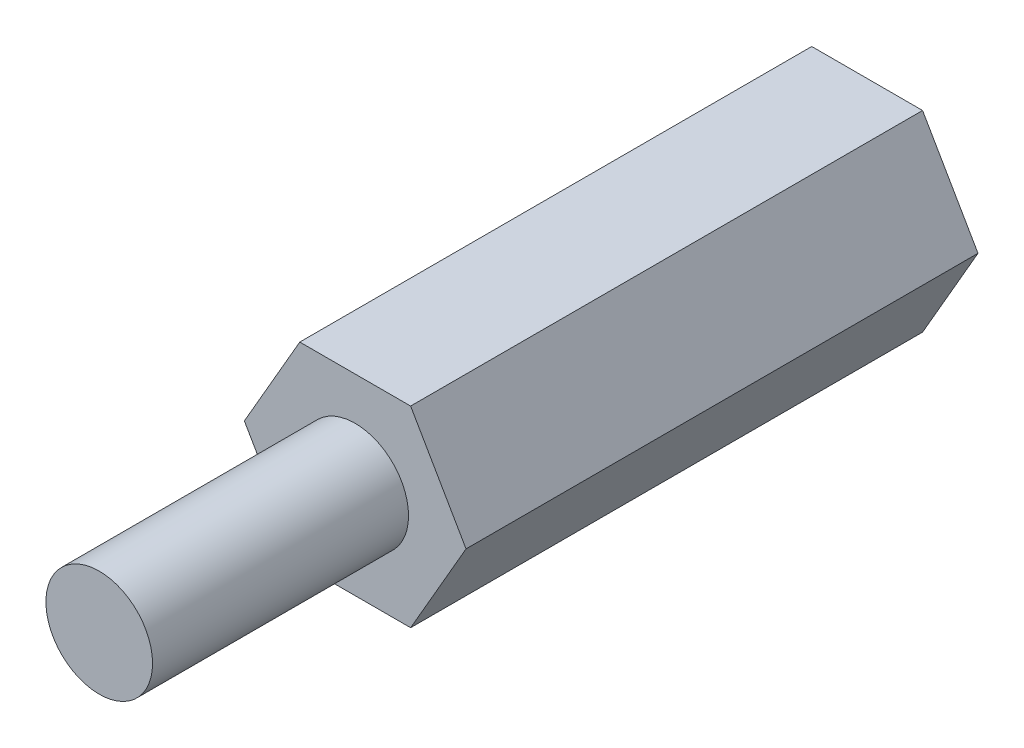
ISO-10303-21;
HEADER;
FILE_DESCRIPTION(('STEP AP214'),'2;1');
FILE_NAME('part.step','',(''),(''),'','','');
FILE_SCHEMA(('AUTOMOTIVE_DESIGN { 1 0 10303 214 1 1 1 1 }'));
ENDSEC;
DATA;
#1=APPLICATION_CONTEXT('core data for automotive mechanical design processes');
#2=APPLICATION_PROTOCOL_DEFINITION('international standard','automotive_design',2000,#1);
#3=PRODUCT_CONTEXT('',#1,'mechanical');
#4=PRODUCT('Part','Part','',(#3));
#5=PRODUCT_RELATED_PRODUCT_CATEGORY('part','',(#4));
#6=PRODUCT_DEFINITION_FORMATION('','',#4);
#7=PRODUCT_DEFINITION_CONTEXT('part definition',#1,'design');
#8=PRODUCT_DEFINITION('design','',#6,#7);
#9=PRODUCT_DEFINITION_SHAPE('','',#8);
#10=(LENGTH_UNIT() NAMED_UNIT(*) SI_UNIT(.MILLI.,.METRE.));
#11=(NAMED_UNIT(*) PLANE_ANGLE_UNIT() SI_UNIT($,.RADIAN.));
#12=(NAMED_UNIT(*) SI_UNIT($,.STERADIAN.) SOLID_ANGLE_UNIT());
#13=UNCERTAINTY_MEASURE_WITH_UNIT(LENGTH_MEASURE(1.E-05),#10,'distance_accuracy_value','');
#14=(GEOMETRIC_REPRESENTATION_CONTEXT(3) GLOBAL_UNCERTAINTY_ASSIGNED_CONTEXT((#13)) GLOBAL_UNIT_ASSIGNED_CONTEXT((#10,
#11,#12)) REPRESENTATION_CONTEXT('',''));
#15=CARTESIAN_POINT('',(0.,0.,0.));
#16=DIRECTION('',(0.,0.,1.));
#17=DIRECTION('',(1.,0.,0.));
#18=AXIS2_PLACEMENT_3D('',#15,#16,#17);
#19=CARTESIAN_POINT('',(1.29903810567668,-2.24999999999998,12.));
#20=DIRECTION('',(-0.866025403784441,0.499999999999995,0.));
#21=DIRECTION('',(-0.499999999999995,-0.866025403784441,0.));
#22=AXIS2_PLACEMENT_3D('',#19,#20,#21);
#23=PLANE('',#22);
#24=DIRECTION('',(0.499999999999995,0.866025403784441,0.));
#25=VECTOR('',#24,1.);
#26=CARTESIAN_POINT('',(1.29903810567668,-2.24999999999998,0.));
#27=LINE('',#26,#25);
#28=CARTESIAN_POINT('',(1.29903810567668,-2.24999999999998,0.));
#29=VERTEX_POINT('',#28);
#30=CARTESIAN_POINT('',(2.59807621135331,0.,0.));
#31=VERTEX_POINT('',#30);
#32=EDGE_CURVE('E136',#29,#31,#27,.T.);
#33=ORIENTED_EDGE('',*,*,#32,.T.);
#34=DIRECTION('',(0.,0.,-1.));
#35=VECTOR('',#34,1.);
#36=CARTESIAN_POINT('',(2.59807621135331,0.,12.));
#37=LINE('',#36,#35);
#38=CARTESIAN_POINT('',(2.59807621135331,0.,12.));
#39=VERTEX_POINT('',#38);
#40=EDGE_CURVE('E51',#39,#31,#37,.T.);
#41=ORIENTED_EDGE('',*,*,#40,.F.);
#42=DIRECTION('',(0.499999999999995,0.866025403784441,0.));
#43=VECTOR('',#42,1.);
#44=CARTESIAN_POINT('',(1.29903810567668,-2.24999999999998,12.));
#45=LINE('',#44,#43);
#46=CARTESIAN_POINT('',(1.29903810567668,-2.24999999999998,12.));
#47=VERTEX_POINT('',#46);
#48=EDGE_CURVE('E147',#47,#39,#45,.T.);
#49=ORIENTED_EDGE('',*,*,#48,.F.);
#50=DIRECTION('',(0.,0.,-1.));
#51=VECTOR('',#50,1.);
#52=CARTESIAN_POINT('',(1.29903810567668,-2.24999999999998,12.));
#53=LINE('',#52,#51);
#54=EDGE_CURVE('E132',#47,#29,#53,.T.);
#55=ORIENTED_EDGE('',*,*,#54,.T.);
#56=EDGE_LOOP('',(#33,#41,#49,#55));
#57=FACE_BOUND('',#56,.T.);
#58=ADVANCED_FACE('F48',(#57),#23,.F.);
#59=CARTESIAN_POINT('',(2.59807621135331,0.,12.));
#60=DIRECTION('',(-0.866025403784438,-0.500000000000001,0.));
#61=DIRECTION('',(0.500000000000001,-0.866025403784438,0.));
#62=AXIS2_PLACEMENT_3D('',#59,#60,#61);
#63=PLANE('',#62);
#64=DIRECTION('',(-0.500000000000001,0.866025403784438,0.));
#65=VECTOR('',#64,1.);
#66=CARTESIAN_POINT('',(2.59807621135331,0.,0.));
#67=LINE('',#66,#65);
#68=CARTESIAN_POINT('',(1.29903810567665,2.25,0.));
#69=VERTEX_POINT('',#68);
#70=EDGE_CURVE('E139',#31,#69,#67,.T.);
#71=ORIENTED_EDGE('',*,*,#70,.T.);
#72=DIRECTION('',(0.,0.,-1.));
#73=VECTOR('',#72,1.);
#74=CARTESIAN_POINT('',(1.29903810567665,2.25,12.));
#75=LINE('',#74,#73);
#76=CARTESIAN_POINT('',(1.29903810567665,2.25,12.));
#77=VERTEX_POINT('',#76);
#78=EDGE_CURVE('E150',#77,#69,#75,.T.);
#79=ORIENTED_EDGE('',*,*,#78,.F.);
#80=DIRECTION('',(-0.500000000000001,0.866025403784438,0.));
#81=VECTOR('',#80,1.);
#82=CARTESIAN_POINT('',(2.59807621135331,0.,12.));
#83=LINE('',#82,#81);
#84=EDGE_CURVE('E104',#39,#77,#83,.T.);
#85=ORIENTED_EDGE('',*,*,#84,.F.);
#86=ORIENTED_EDGE('',*,*,#40,.T.);
#87=EDGE_LOOP('',(#71,#79,#85,#86));
#88=FACE_BOUND('',#87,.T.);
#89=ADVANCED_FACE('F155',(#88),#63,.F.);
#90=CARTESIAN_POINT('',(1.29903810567665,2.25,12.));
#91=DIRECTION('',(0.,-1.,0.));
#92=DIRECTION('',(1.,0.,0.));
#93=AXIS2_PLACEMENT_3D('',#90,#91,#92);
#94=PLANE('',#93);
#95=DIRECTION('',(-1.,0.,0.));
#96=VECTOR('',#95,1.);
#97=CARTESIAN_POINT('',(1.29903810567665,2.25,0.));
#98=LINE('',#97,#96);
#99=CARTESIAN_POINT('',(-1.29903810567667,2.24999999999999,0.));
#100=VERTEX_POINT('',#99);
#101=EDGE_CURVE('E142',#69,#100,#98,.T.);
#102=ORIENTED_EDGE('',*,*,#101,.T.);
#103=DIRECTION('',(0.,0.,-1.));
#104=VECTOR('',#103,1.);
#105=CARTESIAN_POINT('',(-1.29903810567667,2.24999999999999,12.));
#106=LINE('',#105,#104);
#107=CARTESIAN_POINT('',(-1.29903810567667,2.24999999999999,12.));
#108=VERTEX_POINT('',#107);
#109=EDGE_CURVE('E127',#108,#100,#106,.T.);
#110=ORIENTED_EDGE('',*,*,#109,.F.);
#111=DIRECTION('',(-1.,0.,0.));
#112=VECTOR('',#111,1.);
#113=CARTESIAN_POINT('',(1.29903810567665,2.25,12.));
#114=LINE('',#113,#112);
#115=EDGE_CURVE('E118',#77,#108,#114,.T.);
#116=ORIENTED_EDGE('',*,*,#115,.F.);
#117=ORIENTED_EDGE('',*,*,#78,.T.);
#118=EDGE_LOOP('',(#102,#110,#116,#117));
#119=FACE_BOUND('',#118,.T.);
#120=ADVANCED_FACE('F161',(#119),#94,.F.);
#121=CARTESIAN_POINT('',(-1.29903810567667,2.24999999999999,12.));
#122=DIRECTION('',(0.866025403784441,-0.499999999999995,0.));
#123=DIRECTION('',(0.499999999999995,0.866025403784442,0.));
#124=AXIS2_PLACEMENT_3D('',#121,#122,#123);
#125=PLANE('',#124);
#126=DIRECTION('',(-0.499999999999995,-0.866025403784442,0.));
#127=VECTOR('',#126,1.);
#128=CARTESIAN_POINT('',(-1.29903810567667,2.24999999999999,0.));
#129=LINE('',#128,#127);
#130=CARTESIAN_POINT('',(-2.59807621135331,0.,0.));
#131=VERTEX_POINT('',#130);
#132=EDGE_CURVE('E126',#100,#131,#129,.T.);
#133=ORIENTED_EDGE('',*,*,#132,.T.);
#134=DIRECTION('',(0.,0.,-1.));
#135=VECTOR('',#134,1.);
#136=CARTESIAN_POINT('',(-2.59807621135331,0.,12.));
#137=LINE('',#136,#135);
#138=CARTESIAN_POINT('',(-2.59807621135331,0.,12.));
#139=VERTEX_POINT('',#138);
#140=EDGE_CURVE('E123',#139,#131,#137,.T.);
#141=ORIENTED_EDGE('',*,*,#140,.F.);
#142=DIRECTION('',(-0.499999999999995,-0.866025403784442,0.));
#143=VECTOR('',#142,1.);
#144=CARTESIAN_POINT('',(-1.29903810567667,2.24999999999999,12.));
#145=LINE('',#144,#143);
#146=EDGE_CURVE('E112',#108,#139,#145,.T.);
#147=ORIENTED_EDGE('',*,*,#146,.F.);
#148=ORIENTED_EDGE('',*,*,#109,.T.);
#149=EDGE_LOOP('',(#133,#141,#147,#148));
#150=FACE_BOUND('',#149,.T.);
#151=ADVANCED_FACE('F124',(#150),#125,.F.);
#152=CARTESIAN_POINT('',(-2.59807621135331,0.,12.));
#153=DIRECTION('',(0.866025403784434,0.500000000000007,0.));
#154=DIRECTION('',(-0.500000000000007,0.866025403784435,0.));
#155=AXIS2_PLACEMENT_3D('',#152,#153,#154);
#156=PLANE('',#155);
#157=DIRECTION('',(0.500000000000007,-0.866025403784435,0.));
#158=VECTOR('',#157,1.);
#159=CARTESIAN_POINT('',(-2.59807621135331,0.,0.));
#160=LINE('',#159,#158);
#161=CARTESIAN_POINT('',(-1.29903810567663,-2.25000000000001,0.));
#162=VERTEX_POINT('',#161);
#163=EDGE_CURVE('E89',#131,#162,#160,.T.);
#164=ORIENTED_EDGE('',*,*,#163,.T.);
#165=DIRECTION('',(0.,0.,-1.));
#166=VECTOR('',#165,1.);
#167=CARTESIAN_POINT('',(-1.29903810567663,-2.25000000000001,12.));
#168=LINE('',#167,#166);
#169=CARTESIAN_POINT('',(-1.29903810567663,-2.25000000000001,12.));
#170=VERTEX_POINT('',#169);
#171=EDGE_CURVE('E128',#170,#162,#168,.T.);
#172=ORIENTED_EDGE('',*,*,#171,.F.);
#173=DIRECTION('',(0.500000000000007,-0.866025403784435,0.));
#174=VECTOR('',#173,1.);
#175=CARTESIAN_POINT('',(-2.59807621135331,0.,12.));
#176=LINE('',#175,#174);
#177=EDGE_CURVE('E116',#139,#170,#176,.T.);
#178=ORIENTED_EDGE('',*,*,#177,.F.);
#179=ORIENTED_EDGE('',*,*,#140,.T.);
#180=EDGE_LOOP('',(#164,#172,#178,#179));
#181=FACE_BOUND('',#180,.T.);
#182=ADVANCED_FACE('F130',(#181),#156,.F.);
#183=CARTESIAN_POINT('',(-1.29903810567663,-2.25000000000001,12.));
#184=DIRECTION('',(0.,1.,0.));
#185=DIRECTION('',(-1.,0.,0.));
#186=AXIS2_PLACEMENT_3D('',#183,#184,#185);
#187=PLANE('',#186);
#188=DIRECTION('',(1.,0.,0.));
#189=VECTOR('',#188,1.);
#190=CARTESIAN_POINT('',(-1.29903810567663,-2.25000000000001,0.));
#191=LINE('',#190,#189);
#192=EDGE_CURVE('E95',#162,#29,#191,.T.);
#193=ORIENTED_EDGE('',*,*,#192,.T.);
#194=ORIENTED_EDGE('',*,*,#54,.F.);
#195=DIRECTION('',(1.,0.,0.));
#196=VECTOR('',#195,1.);
#197=CARTESIAN_POINT('',(-1.29903810567663,-2.25000000000001,12.));
#198=LINE('',#197,#196);
#199=EDGE_CURVE('E65',#170,#47,#198,.T.);
#200=ORIENTED_EDGE('',*,*,#199,.F.);
#201=ORIENTED_EDGE('',*,*,#171,.T.);
#202=EDGE_LOOP('',(#193,#194,#200,#201));
#203=FACE_BOUND('',#202,.T.);
#204=ADVANCED_FACE('F186',(#203),#187,.F.);
#205=CARTESIAN_POINT('',(0.,0.,12.));
#206=DIRECTION('',(0.,0.,1.));
#207=DIRECTION('',(1.,0.,0.));
#208=AXIS2_PLACEMENT_3D('',#205,#206,#207);
#209=PLANE('',#208);
#210=CARTESIAN_POINT('',(0.,0.,12.));
#211=DIRECTION('',(0.,0.,1.));
#212=DIRECTION('',(1.,0.,0.));
#213=AXIS2_PLACEMENT_3D('',#210,#211,#212);
#214=CIRCLE('',#213,1.25);
#215=CARTESIAN_POINT('',(1.25,0.,12.));
#216=VERTEX_POINT('',#215);
#217=EDGE_CURVE('E11',#216,#216,#214,.T.);
#218=ORIENTED_EDGE('',*,*,#217,.F.);
#219=EDGE_LOOP('',(#218));
#220=FACE_BOUND('',#219,.T.);
#221=ORIENTED_EDGE('',*,*,#48,.T.);
#222=ORIENTED_EDGE('',*,*,#84,.T.);
#223=ORIENTED_EDGE('',*,*,#115,.T.);
#224=ORIENTED_EDGE('',*,*,#146,.T.);
#225=ORIENTED_EDGE('',*,*,#177,.T.);
#226=ORIENTED_EDGE('',*,*,#199,.T.);
#227=EDGE_LOOP('',(#221,#222,#223,#224,#225,#226));
#228=FACE_BOUND('',#227,.T.);
#229=ADVANCED_FACE('F114',(#220,#228),#209,.T.);
#230=CARTESIAN_POINT('',(0.,0.,0.));
#231=DIRECTION('',(0.,0.,1.));
#232=DIRECTION('',(1.,0.,0.));
#233=AXIS2_PLACEMENT_3D('',#230,#231,#232);
#234=PLANE('',#233);
#235=CARTESIAN_POINT('',(0.,0.,0.));
#236=DIRECTION('',(0.,0.,-1.));
#237=DIRECTION('',(-1.,0.,0.));
#238=AXIS2_PLACEMENT_3D('',#235,#236,#237);
#239=CIRCLE('',#238,1.24999999999999);
#240=CARTESIAN_POINT('',(-1.24999999999999,0.,0.));
#241=VERTEX_POINT('',#240);
#242=EDGE_CURVE('E170',#241,#241,#239,.T.);
#243=ORIENTED_EDGE('',*,*,#242,.F.);
#244=EDGE_LOOP('',(#243));
#245=FACE_BOUND('',#244,.T.);
#246=ORIENTED_EDGE('',*,*,#32,.F.);
#247=ORIENTED_EDGE('',*,*,#192,.F.);
#248=ORIENTED_EDGE('',*,*,#163,.F.);
#249=ORIENTED_EDGE('',*,*,#132,.F.);
#250=ORIENTED_EDGE('',*,*,#101,.F.);
#251=ORIENTED_EDGE('',*,*,#70,.F.);
#252=EDGE_LOOP('',(#246,#247,#248,#249,#250,#251));
#253=FACE_BOUND('',#252,.T.);
#254=ADVANCED_FACE('F160',(#245,#253),#234,.F.);
#255=CARTESIAN_POINT('',(0.,0.,18.));
#256=DIRECTION('',(0.,0.,-1.));
#257=DIRECTION('',(-1.,0.,0.));
#258=AXIS2_PLACEMENT_3D('',#255,#256,#257);
#259=CYLINDRICAL_SURFACE('',#258,1.25);
#260=CARTESIAN_POINT('',(0.,0.,18.));
#261=DIRECTION('',(0.,0.,1.));
#262=DIRECTION('',(1.,0.,0.));
#263=AXIS2_PLACEMENT_3D('',#260,#261,#262);
#264=CIRCLE('',#263,1.25);
#265=CARTESIAN_POINT('',(1.25,0.,18.));
#266=VERTEX_POINT('',#265);
#267=EDGE_CURVE('E140',#266,#266,#264,.T.);
#268=ORIENTED_EDGE('',*,*,#267,.F.);
#269=EDGE_LOOP('',(#268));
#270=FACE_BOUND('',#269,.T.);
#271=ORIENTED_EDGE('',*,*,#217,.T.);
#272=EDGE_LOOP('',(#271));
#273=FACE_BOUND('',#272,.T.);
#274=ADVANCED_FACE('F177',(#270,#273),#259,.T.);
#275=CARTESIAN_POINT('',(0.,0.,18.));
#276=DIRECTION('',(0.,0.,1.));
#277=DIRECTION('',(1.,0.,0.));
#278=AXIS2_PLACEMENT_3D('',#275,#276,#277);
#279=PLANE('',#278);
#280=ORIENTED_EDGE('',*,*,#267,.T.);
#281=EDGE_LOOP('',(#280));
#282=FACE_BOUND('',#281,.T.);
#283=ADVANCED_FACE('F183',(#282),#279,.T.);
#284=CARTESIAN_POINT('',(0.,0.,7.50000000000001));
#285=DIRECTION('',(0.,0.,-1.));
#286=DIRECTION('',(-1.,0.,0.));
#287=AXIS2_PLACEMENT_3D('',#284,#285,#286);
#288=CONICAL_SURFACE('',#287,1.24999999999999,1.02974425867665);
#289=CARTESIAN_POINT('',(0.,0.,8.25107577378445));
#290=VERTEX_POINT('',#289);
#291=VERTEX_LOOP('',#290);
#292=FACE_BOUND('',#291,.T.);
#293=CARTESIAN_POINT('',(0.,0.,7.50000000000001));
#294=DIRECTION('',(0.,0.,-1.));
#295=DIRECTION('',(-1.,0.,0.));
#296=AXIS2_PLACEMENT_3D('',#293,#294,#295);
#297=CIRCLE('',#296,1.24999999999999);
#298=CARTESIAN_POINT('',(-1.24999999999999,0.,7.50000000000001));
#299=VERTEX_POINT('',#298);
#300=EDGE_CURVE('E167',#299,#299,#297,.T.);
#301=ORIENTED_EDGE('',*,*,#300,.T.);
#302=EDGE_LOOP('',(#301));
#303=FACE_BOUND('',#302,.T.);
#304=ADVANCED_FACE('F231',(#292,#303),#288,.F.);
#305=CARTESIAN_POINT('',(0.,0.,0.));
#306=DIRECTION('',(0.,0.,-1.));
#307=DIRECTION('',(-1.,0.,0.));
#308=AXIS2_PLACEMENT_3D('',#305,#306,#307);
#309=CYLINDRICAL_SURFACE('',#308,1.24999999999999);
#310=ORIENTED_EDGE('',*,*,#300,.F.);
#311=EDGE_LOOP('',(#310));
#312=FACE_BOUND('',#311,.T.);
#313=ORIENTED_EDGE('',*,*,#242,.T.);
#314=EDGE_LOOP('',(#313));
#315=FACE_BOUND('',#314,.T.);
#316=ADVANCED_FACE('F174',(#312,#315),#309,.F.);
#317=CLOSED_SHELL('',(#58,#89,#120,#151,#182,#204,#229,#254,#274,#283,#304,#316));
#318=MANIFOLD_SOLID_BREP('B2',#317);
#319=ADVANCED_BREP_SHAPE_REPRESENTATION('',(#18,#318),#14);
#320=SHAPE_DEFINITION_REPRESENTATION(#9,#319);
ENDSEC;
END-ISO-10303-21;
